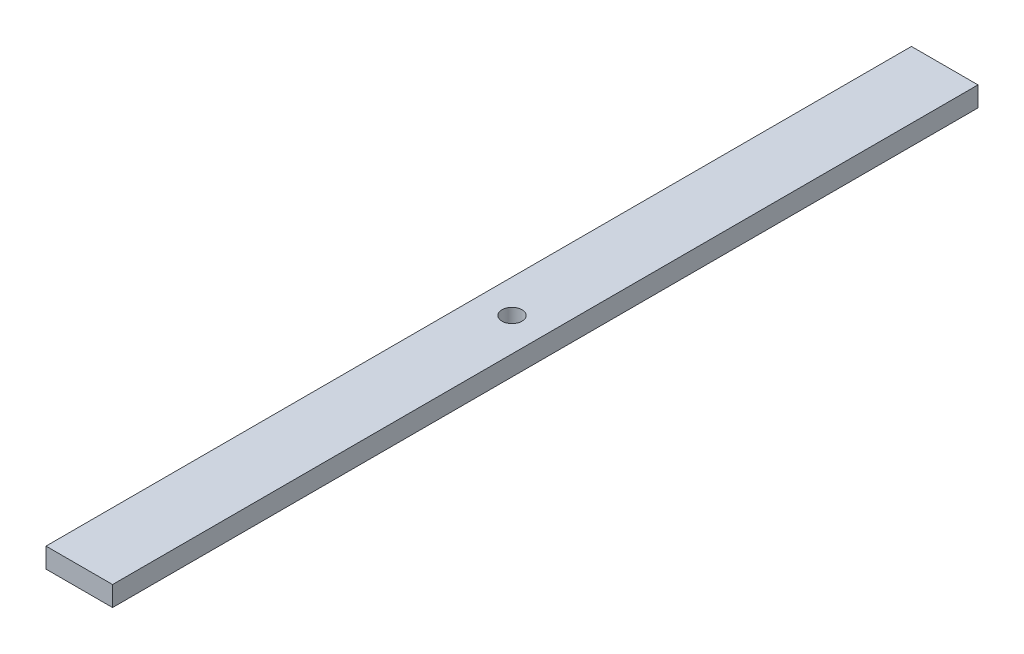
ISO-10303-21;
HEADER;
FILE_DESCRIPTION(('STEP AP214'),'2;1');
FILE_NAME('part.step','',(''),(''),'','','');
FILE_SCHEMA(('AUTOMOTIVE_DESIGN { 1 0 10303 214 1 1 1 1 }'));
ENDSEC;
DATA;
#1=APPLICATION_CONTEXT('core data for automotive mechanical design processes');
#2=APPLICATION_PROTOCOL_DEFINITION('international standard','automotive_design',2000,#1);
#3=PRODUCT_CONTEXT('',#1,'mechanical');
#4=PRODUCT('Part','Part','',(#3));
#5=PRODUCT_RELATED_PRODUCT_CATEGORY('part','',(#4));
#6=PRODUCT_DEFINITION_FORMATION('','',#4);
#7=PRODUCT_DEFINITION_CONTEXT('part definition',#1,'design');
#8=PRODUCT_DEFINITION('design','',#6,#7);
#9=PRODUCT_DEFINITION_SHAPE('','',#8);
#10=(LENGTH_UNIT() NAMED_UNIT(*) SI_UNIT(.MILLI.,.METRE.));
#11=(NAMED_UNIT(*) PLANE_ANGLE_UNIT() SI_UNIT($,.RADIAN.));
#12=(NAMED_UNIT(*) SI_UNIT($,.STERADIAN.) SOLID_ANGLE_UNIT());
#13=UNCERTAINTY_MEASURE_WITH_UNIT(LENGTH_MEASURE(1.E-05),#10,'distance_accuracy_value','');
#14=(GEOMETRIC_REPRESENTATION_CONTEXT(3) GLOBAL_UNCERTAINTY_ASSIGNED_CONTEXT((#13)) GLOBAL_UNIT_ASSIGNED_CONTEXT((#10,
#11,#12)) REPRESENTATION_CONTEXT('',''));
#15=CARTESIAN_POINT('',(0.,0.,0.));
#16=DIRECTION('',(0.,0.,1.));
#17=DIRECTION('',(1.,0.,0.));
#18=AXIS2_PLACEMENT_3D('',#15,#16,#17);
#19=CARTESIAN_POINT('',(0.,3.,0.));
#20=DIRECTION('',(0.,1.,0.));
#21=DIRECTION('',(0.,0.,1.));
#22=AXIS2_PLACEMENT_3D('',#19,#20,#21);
#23=PLANE('',#22);
#24=DIRECTION('',(0.,0.,1.));
#25=VECTOR('',#24,1.);
#26=CARTESIAN_POINT('',(-5.,3.,65.));
#27=LINE('',#26,#25);
#28=CARTESIAN_POINT('',(-5.,3.,-65.));
#29=VERTEX_POINT('',#28);
#30=CARTESIAN_POINT('',(-5.,3.,65.));
#31=VERTEX_POINT('',#30);
#32=EDGE_CURVE('E85',#29,#31,#27,.T.);
#33=ORIENTED_EDGE('',*,*,#32,.T.);
#34=DIRECTION('',(1.,0.,0.));
#35=VECTOR('',#34,1.);
#36=CARTESIAN_POINT('',(5.,3.,65.));
#37=LINE('',#36,#35);
#38=CARTESIAN_POINT('',(5.,3.,65.));
#39=VERTEX_POINT('',#38);
#40=EDGE_CURVE('E80',#31,#39,#37,.T.);
#41=ORIENTED_EDGE('',*,*,#40,.T.);
#42=DIRECTION('',(0.,0.,-1.));
#43=VECTOR('',#42,1.);
#44=CARTESIAN_POINT('',(5.,3.,65.));
#45=LINE('',#44,#43);
#46=CARTESIAN_POINT('',(5.,3.,-65.));
#47=VERTEX_POINT('',#46);
#48=EDGE_CURVE('E83',#39,#47,#45,.T.);
#49=ORIENTED_EDGE('',*,*,#48,.T.);
#50=DIRECTION('',(-1.,0.,0.));
#51=VECTOR('',#50,1.);
#52=CARTESIAN_POINT('',(5.,3.,-65.));
#53=LINE('',#52,#51);
#54=EDGE_CURVE('E50',#47,#29,#53,.T.);
#55=ORIENTED_EDGE('',*,*,#54,.T.);
#56=EDGE_LOOP('',(#33,#41,#49,#55));
#57=FACE_BOUND('',#56,.T.);
#58=CARTESIAN_POINT('',(0.,3.,0.));
#59=DIRECTION('',(0.,1.,0.));
#60=DIRECTION('',(0.,0.,1.));
#61=AXIS2_PLACEMENT_3D('',#58,#59,#60);
#62=CIRCLE('',#61,1.5);
#63=CARTESIAN_POINT('',(0.,3.,1.49999999999999));
#64=VERTEX_POINT('',#63);
#65=EDGE_CURVE('E100',#64,#64,#62,.T.);
#66=ORIENTED_EDGE('',*,*,#65,.F.);
#67=EDGE_LOOP('',(#66));
#68=FACE_BOUND('',#67,.T.);
#69=ADVANCED_FACE('F33',(#57,#68),#23,.T.);
#70=CARTESIAN_POINT('',(0.,0.,0.));
#71=DIRECTION('',(0.,1.,0.));
#72=DIRECTION('',(0.,0.,1.));
#73=AXIS2_PLACEMENT_3D('',#70,#71,#72);
#74=PLANE('',#73);
#75=DIRECTION('',(0.,0.,1.));
#76=VECTOR('',#75,1.);
#77=CARTESIAN_POINT('',(-5.,0.,65.));
#78=LINE('',#77,#76);
#79=CARTESIAN_POINT('',(-5.,0.,-65.));
#80=VERTEX_POINT('',#79);
#81=CARTESIAN_POINT('',(-5.,0.,65.));
#82=VERTEX_POINT('',#81);
#83=EDGE_CURVE('E97',#80,#82,#78,.T.);
#84=ORIENTED_EDGE('',*,*,#83,.F.);
#85=DIRECTION('',(-1.,0.,0.));
#86=VECTOR('',#85,1.);
#87=CARTESIAN_POINT('',(5.,0.,-65.));
#88=LINE('',#87,#86);
#89=CARTESIAN_POINT('',(5.,0.,-65.));
#90=VERTEX_POINT('',#89);
#91=EDGE_CURVE('E73',#90,#80,#88,.T.);
#92=ORIENTED_EDGE('',*,*,#91,.F.);
#93=DIRECTION('',(0.,0.,-1.));
#94=VECTOR('',#93,1.);
#95=CARTESIAN_POINT('',(5.,0.,65.));
#96=LINE('',#95,#94);
#97=CARTESIAN_POINT('',(5.,0.,65.));
#98=VERTEX_POINT('',#97);
#99=EDGE_CURVE('E67',#98,#90,#96,.T.);
#100=ORIENTED_EDGE('',*,*,#99,.F.);
#101=DIRECTION('',(1.,0.,0.));
#102=VECTOR('',#101,1.);
#103=CARTESIAN_POINT('',(5.,0.,65.));
#104=LINE('',#103,#102);
#105=EDGE_CURVE('E89',#82,#98,#104,.T.);
#106=ORIENTED_EDGE('',*,*,#105,.F.);
#107=EDGE_LOOP('',(#84,#92,#100,#106));
#108=FACE_BOUND('',#107,.T.);
#109=CARTESIAN_POINT('',(0.,0.,0.));
#110=DIRECTION('',(0.,1.,0.));
#111=DIRECTION('',(0.,0.,1.));
#112=AXIS2_PLACEMENT_3D('',#109,#110,#111);
#113=CIRCLE('',#112,1.5);
#114=CARTESIAN_POINT('',(0.,0.,1.49999999999999));
#115=VERTEX_POINT('',#114);
#116=EDGE_CURVE('E112',#115,#115,#113,.T.);
#117=ORIENTED_EDGE('',*,*,#116,.T.);
#118=EDGE_LOOP('',(#117));
#119=FACE_BOUND('',#118,.T.);
#120=ADVANCED_FACE('F108',(#108,#119),#74,.F.);
#121=CARTESIAN_POINT('',(-5.,3.,65.));
#122=DIRECTION('',(1.,0.,0.));
#123=DIRECTION('',(0.,0.,-1.));
#124=AXIS2_PLACEMENT_3D('',#121,#122,#123);
#125=PLANE('',#124);
#126=ORIENTED_EDGE('',*,*,#83,.T.);
#127=DIRECTION('',(0.,-1.,0.));
#128=VECTOR('',#127,1.);
#129=CARTESIAN_POINT('',(-5.,3.,65.));
#130=LINE('',#129,#128);
#131=EDGE_CURVE('E11',#31,#82,#130,.T.);
#132=ORIENTED_EDGE('',*,*,#131,.F.);
#133=ORIENTED_EDGE('',*,*,#32,.F.);
#134=DIRECTION('',(0.,-1.,0.));
#135=VECTOR('',#134,1.);
#136=CARTESIAN_POINT('',(-5.,3.,-65.));
#137=LINE('',#136,#135);
#138=EDGE_CURVE('E93',#29,#80,#137,.T.);
#139=ORIENTED_EDGE('',*,*,#138,.T.);
#140=EDGE_LOOP('',(#126,#132,#133,#139));
#141=FACE_BOUND('',#140,.T.);
#142=ADVANCED_FACE('F35',(#141),#125,.F.);
#143=CARTESIAN_POINT('',(5.,3.,65.));
#144=DIRECTION('',(0.,0.,-1.));
#145=DIRECTION('',(-1.,0.,0.));
#146=AXIS2_PLACEMENT_3D('',#143,#144,#145);
#147=PLANE('',#146);
#148=ORIENTED_EDGE('',*,*,#105,.T.);
#149=DIRECTION('',(0.,-1.,0.));
#150=VECTOR('',#149,1.);
#151=CARTESIAN_POINT('',(5.,3.,65.));
#152=LINE('',#151,#150);
#153=EDGE_CURVE('E42',#39,#98,#152,.T.);
#154=ORIENTED_EDGE('',*,*,#153,.F.);
#155=ORIENTED_EDGE('',*,*,#40,.F.);
#156=ORIENTED_EDGE('',*,*,#131,.T.);
#157=EDGE_LOOP('',(#148,#154,#155,#156));
#158=FACE_BOUND('',#157,.T.);
#159=ADVANCED_FACE('F88',(#158),#147,.F.);
#160=CARTESIAN_POINT('',(5.,3.,65.));
#161=DIRECTION('',(-1.,0.,0.));
#162=DIRECTION('',(0.,0.,1.));
#163=AXIS2_PLACEMENT_3D('',#160,#161,#162);
#164=PLANE('',#163);
#165=ORIENTED_EDGE('',*,*,#99,.T.);
#166=DIRECTION('',(0.,-1.,0.));
#167=VECTOR('',#166,1.);
#168=CARTESIAN_POINT('',(5.,3.,-65.));
#169=LINE('',#168,#167);
#170=EDGE_CURVE('E90',#47,#90,#169,.T.);
#171=ORIENTED_EDGE('',*,*,#170,.F.);
#172=ORIENTED_EDGE('',*,*,#48,.F.);
#173=ORIENTED_EDGE('',*,*,#153,.T.);
#174=EDGE_LOOP('',(#165,#171,#172,#173));
#175=FACE_BOUND('',#174,.T.);
#176=ADVANCED_FACE('F91',(#175),#164,.F.);
#177=CARTESIAN_POINT('',(5.,3.,-65.));
#178=DIRECTION('',(0.,0.,1.));
#179=DIRECTION('',(1.,0.,0.));
#180=AXIS2_PLACEMENT_3D('',#177,#178,#179);
#181=PLANE('',#180);
#182=ORIENTED_EDGE('',*,*,#91,.T.);
#183=ORIENTED_EDGE('',*,*,#138,.F.);
#184=ORIENTED_EDGE('',*,*,#54,.F.);
#185=ORIENTED_EDGE('',*,*,#170,.T.);
#186=EDGE_LOOP('',(#182,#183,#184,#185));
#187=FACE_BOUND('',#186,.T.);
#188=ADVANCED_FACE('F105',(#187),#181,.F.);
#189=CARTESIAN_POINT('',(0.,3.,0.));
#190=DIRECTION('',(0.,-1.,0.));
#191=DIRECTION('',(0.,0.,-1.));
#192=AXIS2_PLACEMENT_3D('',#189,#190,#191);
#193=CYLINDRICAL_SURFACE('',#192,1.5);
#194=ORIENTED_EDGE('',*,*,#65,.T.);
#195=EDGE_LOOP('',(#194));
#196=FACE_BOUND('',#195,.T.);
#197=ORIENTED_EDGE('',*,*,#116,.F.);
#198=EDGE_LOOP('',(#197));
#199=FACE_BOUND('',#198,.T.);
#200=ADVANCED_FACE('F118',(#196,#199),#193,.F.);
#201=CLOSED_SHELL('',(#69,#120,#142,#159,#176,#188,#200));
#202=MANIFOLD_SOLID_BREP('B2',#201);
#203=ADVANCED_BREP_SHAPE_REPRESENTATION('',(#18,#202),#14);
#204=SHAPE_DEFINITION_REPRESENTATION(#9,#203);
ENDSEC;
END-ISO-10303-21;
